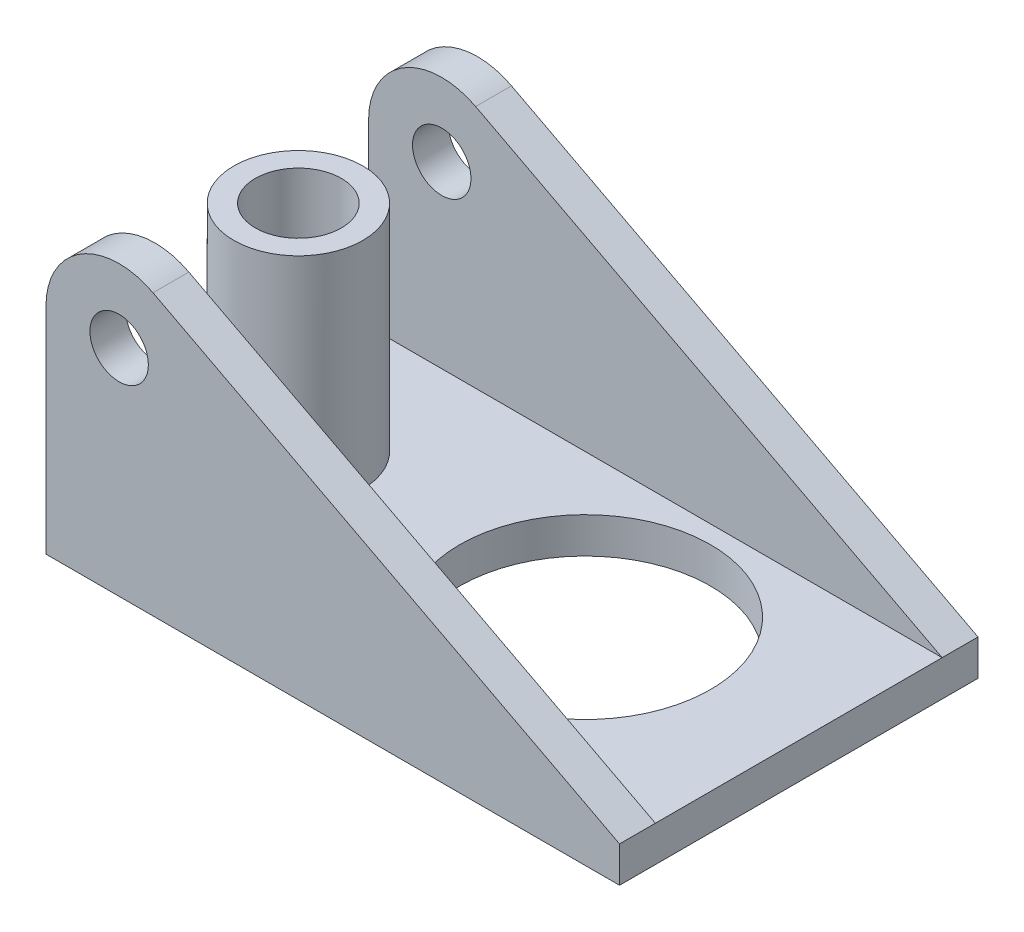
ISO-10303-21;
HEADER;
FILE_DESCRIPTION(('STEP AP214'),'2;1');
FILE_NAME('part.step','',(''),(''),'','','');
FILE_SCHEMA(('AUTOMOTIVE_DESIGN { 1 0 10303 214 1 1 1 1 }'));
ENDSEC;
DATA;
#1=APPLICATION_CONTEXT('core data for automotive mechanical design processes');
#2=APPLICATION_PROTOCOL_DEFINITION('international standard','automotive_design',2000,#1);
#3=PRODUCT_CONTEXT('',#1,'mechanical');
#4=PRODUCT('Part','Part','',(#3));
#5=PRODUCT_RELATED_PRODUCT_CATEGORY('part','',(#4));
#6=PRODUCT_DEFINITION_FORMATION('','',#4);
#7=PRODUCT_DEFINITION_CONTEXT('part definition',#1,'design');
#8=PRODUCT_DEFINITION('design','',#6,#7);
#9=PRODUCT_DEFINITION_SHAPE('','',#8);
#10=(LENGTH_UNIT() NAMED_UNIT(*) SI_UNIT(.MILLI.,.METRE.));
#11=(NAMED_UNIT(*) PLANE_ANGLE_UNIT() SI_UNIT($,.RADIAN.));
#12=(NAMED_UNIT(*) SI_UNIT($,.STERADIAN.) SOLID_ANGLE_UNIT());
#13=UNCERTAINTY_MEASURE_WITH_UNIT(LENGTH_MEASURE(1.E-05),#10,'distance_accuracy_value','');
#14=(GEOMETRIC_REPRESENTATION_CONTEXT(3) GLOBAL_UNCERTAINTY_ASSIGNED_CONTEXT((#13)) GLOBAL_UNIT_ASSIGNED_CONTEXT((#10,
#11,#12)) REPRESENTATION_CONTEXT('',''));
#15=CARTESIAN_POINT('',(0.,0.,0.));
#16=DIRECTION('',(0.,0.,1.));
#17=DIRECTION('',(1.,0.,0.));
#18=AXIS2_PLACEMENT_3D('',#15,#16,#17);
#19=CARTESIAN_POINT('',(0.,0.,-87.401601815985));
#20=DIRECTION('',(0.,-1.,0.));
#21=DIRECTION('',(0.,0.,-1.));
#22=AXIS2_PLACEMENT_3D('',#19,#20,#21);
#23=PLANE('',#22);
#24=DIRECTION('',(0.,0.,1.));
#25=VECTOR('',#24,1.);
#26=CARTESIAN_POINT('',(0.,0.,-87.401601815985));
#27=LINE('',#26,#25);
#28=CARTESIAN_POINT('',(0.,0.,5.));
#29=VERTEX_POINT('',#28);
#30=CARTESIAN_POINT('',(0.,0.,45.));
#31=VERTEX_POINT('',#30);
#32=EDGE_CURVE('E228',#29,#31,#27,.T.);
#33=ORIENTED_EDGE('',*,*,#32,.T.);
#34=DIRECTION('',(1.,0.,0.));
#35=VECTOR('',#34,1.);
#36=CARTESIAN_POINT('',(0.,0.,45.));
#37=LINE('',#36,#35);
#38=CARTESIAN_POINT('',(80.,0.,45.));
#39=VERTEX_POINT('',#38);
#40=EDGE_CURVE('E240',#31,#39,#37,.T.);
#41=ORIENTED_EDGE('',*,*,#40,.T.);
#42=DIRECTION('',(0.,0.,1.));
#43=VECTOR('',#42,1.);
#44=CARTESIAN_POINT('',(80.,0.,-87.401601815985));
#45=LINE('',#44,#43);
#46=CARTESIAN_POINT('',(80.,0.,5.));
#47=VERTEX_POINT('',#46);
#48=EDGE_CURVE('E132',#47,#39,#45,.T.);
#49=ORIENTED_EDGE('',*,*,#48,.F.);
#50=DIRECTION('',(1.,0.,0.));
#51=VECTOR('',#50,1.);
#52=CARTESIAN_POINT('',(0.,0.,5.));
#53=LINE('',#52,#51);
#54=EDGE_CURVE('E236',#29,#47,#53,.T.);
#55=ORIENTED_EDGE('',*,*,#54,.F.);
#56=EDGE_LOOP('',(#33,#41,#49,#55));
#57=FACE_BOUND('',#56,.T.);
#58=CARTESIAN_POINT('',(50.2,0.,25.));
#59=DIRECTION('',(0.,1.,0.));
#60=DIRECTION('',(-1.,0.,0.));
#61=AXIS2_PLACEMENT_3D('',#58,#59,#60);
#62=CIRCLE('',#61,17.5);
#63=CARTESIAN_POINT('',(32.7,0.,25.));
#64=VERTEX_POINT('',#63);
#65=EDGE_CURVE('E259',#64,#64,#62,.T.);
#66=ORIENTED_EDGE('',*,*,#65,.F.);
#67=EDGE_LOOP('',(#66));
#68=FACE_BOUND('',#67,.T.);
#69=CARTESIAN_POINT('',(10.2,0.,25.));
#70=DIRECTION('',(0.,-1.,0.));
#71=DIRECTION('',(0.,0.,-1.));
#72=AXIS2_PLACEMENT_3D('',#69,#70,#71);
#73=CIRCLE('',#72,9.);
#74=CARTESIAN_POINT('',(10.2,0.,16.));
#75=VERTEX_POINT('',#74);
#76=EDGE_CURVE('E12',#75,#75,#73,.F.);
#77=ORIENTED_EDGE('',*,*,#76,.F.);
#78=EDGE_LOOP('',(#77));
#79=FACE_BOUND('',#78,.T.);
#80=ADVANCED_FACE('F49',(#57,#68,#79),#23,.F.);
#81=CARTESIAN_POINT('',(14.9277151352531,34.0381806576268,50.));
#82=DIRECTION('',(-0.463501483848347,-0.886096142904584,0.));
#83=DIRECTION('',(0.886096142904584,-0.463501483848347,0.));
#84=AXIS2_PLACEMENT_3D('',#81,#82,#83);
#85=PLANE('',#84);
#86=DIRECTION('',(0.,0.,-1.));
#87=VECTOR('',#86,1.);
#88=CARTESIAN_POINT('',(14.9277151352531,34.0381806576268,50.));
#89=LINE('',#88,#87);
#90=CARTESIAN_POINT('',(14.9277151352531,34.0381806576268,5.));
#91=VERTEX_POINT('',#90);
#92=CARTESIAN_POINT('',(14.9277151352531,34.0381806576268,0.));
#93=VERTEX_POINT('',#92);
#94=EDGE_CURVE('E170',#91,#93,#89,.T.);
#95=ORIENTED_EDGE('',*,*,#94,.F.);
#96=DIRECTION('',(-0.886096142904584,0.463501483848347,0.));
#97=VECTOR('',#96,1.);
#98=CARTESIAN_POINT('',(80.,0.,5.));
#99=LINE('',#98,#97);
#100=EDGE_CURVE('E214',#47,#91,#99,.T.);
#101=ORIENTED_EDGE('',*,*,#100,.F.);
#102=DIRECTION('',(0.,0.,-1.));
#103=VECTOR('',#102,1.);
#104=CARTESIAN_POINT('',(80.,0.,50.));
#105=LINE('',#104,#103);
#106=CARTESIAN_POINT('',(80.,0.,0.));
#107=VERTEX_POINT('',#106);
#108=EDGE_CURVE('E137',#47,#107,#105,.T.);
#109=ORIENTED_EDGE('',*,*,#108,.T.);
#110=DIRECTION('',(-0.886096142904584,0.463501483848347,0.));
#111=VECTOR('',#110,1.);
#112=CARTESIAN_POINT('',(14.9277151352531,34.0381806576268,0.));
#113=LINE('',#112,#111);
#114=EDGE_CURVE('E157',#107,#93,#113,.T.);
#115=ORIENTED_EDGE('',*,*,#114,.T.);
#116=EDGE_LOOP('',(#95,#101,#109,#115));
#117=FACE_BOUND('',#116,.T.);
#118=ADVANCED_FACE('F210',(#117),#85,.F.);
#119=CARTESIAN_POINT('',(10.2,25.,50.));
#120=DIRECTION('',(0.,0.,-1.));
#121=DIRECTION('',(-1.,0.,0.));
#122=AXIS2_PLACEMENT_3D('',#119,#120,#121);
#123=CYLINDRICAL_SURFACE('',#122,10.2);
#124=DIRECTION('',(0.,0.,-1.));
#125=VECTOR('',#124,1.);
#126=CARTESIAN_POINT('',(0.,25.,50.));
#127=LINE('',#126,#125);
#128=CARTESIAN_POINT('',(0.,25.,5.));
#129=VERTEX_POINT('',#128);
#130=CARTESIAN_POINT('',(0.,25.,0.));
#131=VERTEX_POINT('',#130);
#132=EDGE_CURVE('E97',#129,#131,#127,.T.);
#133=ORIENTED_EDGE('',*,*,#132,.F.);
#134=CARTESIAN_POINT('',(10.2,25.,5.));
#135=DIRECTION('',(0.,0.,-1.));
#136=DIRECTION('',(-1.,0.,0.));
#137=AXIS2_PLACEMENT_3D('',#134,#135,#136);
#138=CIRCLE('',#137,10.2);
#139=EDGE_CURVE('E221',#91,#129,#138,.F.);
#140=ORIENTED_EDGE('',*,*,#139,.F.);
#141=ORIENTED_EDGE('',*,*,#94,.T.);
#142=CARTESIAN_POINT('',(10.2,25.,0.));
#143=DIRECTION('',(0.,0.,1.));
#144=DIRECTION('',(-1.,0.,0.));
#145=AXIS2_PLACEMENT_3D('',#142,#143,#144);
#146=CIRCLE('',#145,10.2);
#147=EDGE_CURVE('E161',#93,#131,#146,.T.);
#148=ORIENTED_EDGE('',*,*,#147,.T.);
#149=EDGE_LOOP('',(#133,#140,#141,#148));
#150=FACE_BOUND('',#149,.T.);
#151=ADVANCED_FACE('F220',(#150),#123,.T.);
#152=CARTESIAN_POINT('',(10.2,25.,50.));
#153=DIRECTION('',(0.,0.,-1.));
#154=DIRECTION('',(-1.,0.,0.));
#155=AXIS2_PLACEMENT_3D('',#152,#153,#154);
#156=CYLINDRICAL_SURFACE('',#155,4.075);
#157=CARTESIAN_POINT('',(10.2,25.,5.));
#158=DIRECTION('',(0.,0.,-1.));
#159=DIRECTION('',(-1.,0.,0.));
#160=AXIS2_PLACEMENT_3D('',#157,#158,#159);
#161=CIRCLE('',#160,4.075);
#162=CARTESIAN_POINT('',(6.125,25.,5.));
#163=VERTEX_POINT('',#162);
#164=EDGE_CURVE('E180',#163,#163,#161,.T.);
#165=ORIENTED_EDGE('',*,*,#164,.F.);
#166=EDGE_LOOP('',(#165));
#167=FACE_BOUND('',#166,.T.);
#168=CARTESIAN_POINT('',(10.2,25.,0.));
#169=DIRECTION('',(0.,0.,1.));
#170=DIRECTION('',(1.,0.,0.));
#171=AXIS2_PLACEMENT_3D('',#168,#169,#170);
#172=CIRCLE('',#171,4.075);
#173=CARTESIAN_POINT('',(14.275,25.,0.));
#174=VERTEX_POINT('',#173);
#175=EDGE_CURVE('E183',#174,#174,#172,.T.);
#176=ORIENTED_EDGE('',*,*,#175,.F.);
#177=EDGE_LOOP('',(#176));
#178=FACE_BOUND('',#177,.T.);
#179=ADVANCED_FACE('F311',(#167,#178),#156,.F.);
#180=CARTESIAN_POINT('',(10.2,25.,50.));
#181=DIRECTION('',(0.,0.,-1.));
#182=DIRECTION('',(-1.,0.,0.));
#183=AXIS2_PLACEMENT_3D('',#180,#181,#182);
#184=PLANE('',#183);
#185=DIRECTION('',(0.,-1.,0.));
#186=VECTOR('',#185,1.);
#187=CARTESIAN_POINT('',(0.,0.,50.));
#188=LINE('',#187,#186);
#189=CARTESIAN_POINT('',(0.,25.,50.));
#190=VERTEX_POINT('',#189);
#191=CARTESIAN_POINT('',(0.,-5.,50.));
#192=VERTEX_POINT('',#191);
#193=EDGE_CURVE('E74',#190,#192,#188,.T.);
#194=ORIENTED_EDGE('',*,*,#193,.T.);
#195=DIRECTION('',(1.,0.,0.));
#196=VECTOR('',#195,1.);
#197=CARTESIAN_POINT('',(0.,-5.,50.));
#198=LINE('',#197,#196);
#199=CARTESIAN_POINT('',(80.,-5.,50.));
#200=VERTEX_POINT('',#199);
#201=EDGE_CURVE('E106',#192,#200,#198,.T.);
#202=ORIENTED_EDGE('',*,*,#201,.T.);
#203=DIRECTION('',(0.,1.,0.));
#204=VECTOR('',#203,1.);
#205=CARTESIAN_POINT('',(80.,-5.,50.));
#206=LINE('',#205,#204);
#207=CARTESIAN_POINT('',(80.,0.,50.));
#208=VERTEX_POINT('',#207);
#209=EDGE_CURVE('E114',#200,#208,#206,.T.);
#210=ORIENTED_EDGE('',*,*,#209,.T.);
#211=DIRECTION('',(-0.886096142904584,0.463501483848347,0.));
#212=VECTOR('',#211,1.);
#213=CARTESIAN_POINT('',(14.9277151352531,34.0381806576268,50.));
#214=LINE('',#213,#212);
#215=CARTESIAN_POINT('',(14.9277151352531,34.0381806576268,50.));
#216=VERTEX_POINT('',#215);
#217=EDGE_CURVE('E119',#208,#216,#214,.T.);
#218=ORIENTED_EDGE('',*,*,#217,.T.);
#219=CARTESIAN_POINT('',(10.2,25.,50.));
#220=DIRECTION('',(0.,0.,1.));
#221=DIRECTION('',(-1.,0.,0.));
#222=AXIS2_PLACEMENT_3D('',#219,#220,#221);
#223=CIRCLE('',#222,10.2);
#224=EDGE_CURVE('E144',#216,#190,#223,.T.);
#225=ORIENTED_EDGE('',*,*,#224,.T.);
#226=EDGE_LOOP('',(#194,#202,#210,#218,#225));
#227=FACE_BOUND('',#226,.T.);
#228=CARTESIAN_POINT('',(10.2,25.,50.));
#229=DIRECTION('',(0.,0.,1.));
#230=DIRECTION('',(1.,0.,0.));
#231=AXIS2_PLACEMENT_3D('',#228,#229,#230);
#232=CIRCLE('',#231,4.075);
#233=CARTESIAN_POINT('',(14.275,25.,50.));
#234=VERTEX_POINT('',#233);
#235=EDGE_CURVE('E154',#234,#234,#232,.T.);
#236=ORIENTED_EDGE('',*,*,#235,.F.);
#237=EDGE_LOOP('',(#236));
#238=FACE_BOUND('',#237,.T.);
#239=ADVANCED_FACE('F116',(#227,#238),#184,.F.);
#240=CARTESIAN_POINT('',(10.2,25.,0.));
#241=DIRECTION('',(0.,0.,-1.));
#242=DIRECTION('',(-1.,0.,0.));
#243=AXIS2_PLACEMENT_3D('',#240,#241,#242);
#244=PLANE('',#243);
#245=DIRECTION('',(1.,0.,0.));
#246=VECTOR('',#245,1.);
#247=CARTESIAN_POINT('',(0.,-5.,0.));
#248=LINE('',#247,#246);
#249=CARTESIAN_POINT('',(0.,-5.,0.));
#250=VERTEX_POINT('',#249);
#251=CARTESIAN_POINT('',(80.,-5.,0.));
#252=VERTEX_POINT('',#251);
#253=EDGE_CURVE('E150',#250,#252,#248,.T.);
#254=ORIENTED_EDGE('',*,*,#253,.F.);
#255=DIRECTION('',(0.,-1.,0.));
#256=VECTOR('',#255,1.);
#257=CARTESIAN_POINT('',(0.,0.,0.));
#258=LINE('',#257,#256);
#259=EDGE_CURVE('E164',#131,#250,#258,.T.);
#260=ORIENTED_EDGE('',*,*,#259,.F.);
#261=ORIENTED_EDGE('',*,*,#147,.F.);
#262=ORIENTED_EDGE('',*,*,#114,.F.);
#263=DIRECTION('',(0.,1.,0.));
#264=VECTOR('',#263,1.);
#265=CARTESIAN_POINT('',(80.,-5.,0.));
#266=LINE('',#265,#264);
#267=EDGE_CURVE('E153',#252,#107,#266,.T.);
#268=ORIENTED_EDGE('',*,*,#267,.F.);
#269=EDGE_LOOP('',(#254,#260,#261,#262,#268));
#270=FACE_BOUND('',#269,.T.);
#271=ORIENTED_EDGE('',*,*,#175,.T.);
#272=EDGE_LOOP('',(#271));
#273=FACE_BOUND('',#272,.T.);
#274=ADVANCED_FACE('F206',(#270,#273),#244,.T.);
#275=CARTESIAN_POINT('',(0.,-5.,50.));
#276=DIRECTION('',(0.,1.,0.));
#277=DIRECTION('',(-1.,0.,0.));
#278=AXIS2_PLACEMENT_3D('',#275,#276,#277);
#279=PLANE('',#278);
#280=CARTESIAN_POINT('',(10.2,-5.,25.));
#281=DIRECTION('',(0.,1.,0.));
#282=DIRECTION('',(-1.,0.,0.));
#283=AXIS2_PLACEMENT_3D('',#280,#281,#282);
#284=CIRCLE('',#283,6.);
#285=CARTESIAN_POINT('',(4.2,-5.,25.));
#286=VERTEX_POINT('',#285);
#287=EDGE_CURVE('E245',#286,#286,#284,.T.);
#288=ORIENTED_EDGE('',*,*,#287,.T.);
#289=EDGE_LOOP('',(#288));
#290=FACE_BOUND('',#289,.T.);
#291=CARTESIAN_POINT('',(50.2,-5.,25.));
#292=DIRECTION('',(0.,1.,0.));
#293=DIRECTION('',(-1.,0.,0.));
#294=AXIS2_PLACEMENT_3D('',#291,#292,#293);
#295=CIRCLE('',#294,17.5);
#296=CARTESIAN_POINT('',(32.7,-5.,25.));
#297=VERTEX_POINT('',#296);
#298=EDGE_CURVE('E255',#297,#297,#295,.T.);
#299=ORIENTED_EDGE('',*,*,#298,.T.);
#300=EDGE_LOOP('',(#299));
#301=FACE_BOUND('',#300,.T.);
#302=ORIENTED_EDGE('',*,*,#253,.T.);
#303=DIRECTION('',(0.,0.,-1.));
#304=VECTOR('',#303,1.);
#305=CARTESIAN_POINT('',(80.,-5.,50.));
#306=LINE('',#305,#304);
#307=EDGE_CURVE('E136',#200,#252,#306,.T.);
#308=ORIENTED_EDGE('',*,*,#307,.F.);
#309=ORIENTED_EDGE('',*,*,#201,.F.);
#310=DIRECTION('',(0.,0.,-1.));
#311=VECTOR('',#310,1.);
#312=CARTESIAN_POINT('',(0.,-5.,50.));
#313=LINE('',#312,#311);
#314=EDGE_CURVE('E58',#192,#250,#313,.T.);
#315=ORIENTED_EDGE('',*,*,#314,.T.);
#316=EDGE_LOOP('',(#302,#308,#309,#315));
#317=FACE_BOUND('',#316,.T.);
#318=ADVANCED_FACE('F51',(#290,#301,#317),#279,.F.);
#319=CARTESIAN_POINT('',(80.,-5.,50.));
#320=DIRECTION('',(-1.,0.,0.));
#321=DIRECTION('',(0.,0.,1.));
#322=AXIS2_PLACEMENT_3D('',#319,#320,#321);
#323=PLANE('',#322);
#324=ORIENTED_EDGE('',*,*,#267,.T.);
#325=ORIENTED_EDGE('',*,*,#108,.F.);
#326=ORIENTED_EDGE('',*,*,#48,.T.);
#327=EDGE_CURVE('E127',#208,#39,#105,.T.);
#328=ORIENTED_EDGE('',*,*,#327,.F.);
#329=ORIENTED_EDGE('',*,*,#209,.F.);
#330=ORIENTED_EDGE('',*,*,#307,.T.);
#331=EDGE_LOOP('',(#324,#325,#326,#328,#329,#330));
#332=FACE_BOUND('',#331,.T.);
#333=ADVANCED_FACE('F129',(#332),#323,.F.);
#334=ORIENTED_EDGE('',*,*,#327,.T.);
#335=DIRECTION('',(-0.886096142904584,0.463501483848347,0.));
#336=VECTOR('',#335,1.);
#337=CARTESIAN_POINT('',(80.,0.,45.));
#338=LINE('',#337,#336);
#339=CARTESIAN_POINT('',(14.9277151352531,34.0381806576268,45.));
#340=VERTEX_POINT('',#339);
#341=EDGE_CURVE('E244',#39,#340,#338,.T.);
#342=ORIENTED_EDGE('',*,*,#341,.T.);
#343=EDGE_CURVE('E141',#216,#340,#89,.T.);
#344=ORIENTED_EDGE('',*,*,#343,.F.);
#345=ORIENTED_EDGE('',*,*,#217,.F.);
#346=EDGE_LOOP('',(#334,#342,#344,#345));
#347=FACE_BOUND('',#346,.T.);
#348=ADVANCED_FACE('F139',(#347),#85,.F.);
#349=ORIENTED_EDGE('',*,*,#343,.T.);
#350=CARTESIAN_POINT('',(10.2,25.,45.));
#351=DIRECTION('',(0.,0.,1.));
#352=DIRECTION('',(1.,0.,0.));
#353=AXIS2_PLACEMENT_3D('',#350,#351,#352);
#354=CIRCLE('',#353,10.2);
#355=CARTESIAN_POINT('',(0.,25.,45.));
#356=VERTEX_POINT('',#355);
#357=EDGE_CURVE('E248',#340,#356,#354,.T.);
#358=ORIENTED_EDGE('',*,*,#357,.T.);
#359=EDGE_CURVE('E167',#190,#356,#127,.T.);
#360=ORIENTED_EDGE('',*,*,#359,.F.);
#361=ORIENTED_EDGE('',*,*,#224,.F.);
#362=EDGE_LOOP('',(#349,#358,#360,#361));
#363=FACE_BOUND('',#362,.T.);
#364=ADVANCED_FACE('F318',(#363),#123,.T.);
#365=CARTESIAN_POINT('',(0.,0.,50.));
#366=DIRECTION('',(1.,0.,0.));
#367=DIRECTION('',(0.,0.,-1.));
#368=AXIS2_PLACEMENT_3D('',#365,#366,#367);
#369=PLANE('',#368);
#370=ORIENTED_EDGE('',*,*,#32,.F.);
#371=DIRECTION('',(0.,-1.,0.));
#372=VECTOR('',#371,1.);
#373=CARTESIAN_POINT('',(0.,25.,5.));
#374=LINE('',#373,#372);
#375=EDGE_CURVE('E65',#129,#29,#374,.T.);
#376=ORIENTED_EDGE('',*,*,#375,.F.);
#377=ORIENTED_EDGE('',*,*,#132,.T.);
#378=ORIENTED_EDGE('',*,*,#259,.T.);
#379=ORIENTED_EDGE('',*,*,#314,.F.);
#380=ORIENTED_EDGE('',*,*,#193,.F.);
#381=ORIENTED_EDGE('',*,*,#359,.T.);
#382=DIRECTION('',(0.,-1.,0.));
#383=VECTOR('',#382,1.);
#384=CARTESIAN_POINT('',(0.,25.,45.));
#385=LINE('',#384,#383);
#386=EDGE_CURVE('E230',#356,#31,#385,.T.);
#387=ORIENTED_EDGE('',*,*,#386,.T.);
#388=EDGE_LOOP('',(#370,#376,#377,#378,#379,#380,#381,#387));
#389=FACE_BOUND('',#388,.T.);
#390=ADVANCED_FACE('F200',(#389),#369,.F.);
#391=CARTESIAN_POINT('',(10.2,25.,45.));
#392=DIRECTION('',(0.,0.,1.));
#393=DIRECTION('',(1.,0.,0.));
#394=AXIS2_PLACEMENT_3D('',#391,#392,#393);
#395=CIRCLE('',#394,4.075);
#396=CARTESIAN_POINT('',(14.275,25.,45.));
#397=VERTEX_POINT('',#396);
#398=EDGE_CURVE('E177',#397,#397,#395,.T.);
#399=ORIENTED_EDGE('',*,*,#398,.F.);
#400=EDGE_LOOP('',(#399));
#401=FACE_BOUND('',#400,.T.);
#402=ORIENTED_EDGE('',*,*,#235,.T.);
#403=EDGE_LOOP('',(#402));
#404=FACE_BOUND('',#403,.T.);
#405=ADVANCED_FACE('F307',(#401,#404),#156,.F.);
#406=CARTESIAN_POINT('',(10.2,25.,5.));
#407=DIRECTION('',(0.,0.,-1.));
#408=DIRECTION('',(-1.,0.,0.));
#409=AXIS2_PLACEMENT_3D('',#406,#407,#408);
#410=PLANE('',#409);
#411=ORIENTED_EDGE('',*,*,#164,.T.);
#412=EDGE_LOOP('',(#411));
#413=FACE_BOUND('',#412,.T.);
#414=ORIENTED_EDGE('',*,*,#54,.T.);
#415=ORIENTED_EDGE('',*,*,#100,.T.);
#416=ORIENTED_EDGE('',*,*,#139,.T.);
#417=ORIENTED_EDGE('',*,*,#375,.T.);
#418=EDGE_LOOP('',(#414,#415,#416,#417));
#419=FACE_BOUND('',#418,.T.);
#420=ADVANCED_FACE('F304',(#413,#419),#410,.F.);
#421=CARTESIAN_POINT('',(10.2,25.,45.));
#422=DIRECTION('',(0.,0.,1.));
#423=DIRECTION('',(1.,0.,0.));
#424=AXIS2_PLACEMENT_3D('',#421,#422,#423);
#425=PLANE('',#424);
#426=ORIENTED_EDGE('',*,*,#398,.T.);
#427=EDGE_LOOP('',(#426));
#428=FACE_BOUND('',#427,.T.);
#429=ORIENTED_EDGE('',*,*,#40,.F.);
#430=ORIENTED_EDGE('',*,*,#386,.F.);
#431=ORIENTED_EDGE('',*,*,#357,.F.);
#432=ORIENTED_EDGE('',*,*,#341,.F.);
#433=EDGE_LOOP('',(#429,#430,#431,#432));
#434=FACE_BOUND('',#433,.T.);
#435=ADVANCED_FACE('F302',(#428,#434),#425,.F.);
#436=CARTESIAN_POINT('',(50.2,-5.,25.));
#437=DIRECTION('',(0.,1.,0.));
#438=DIRECTION('',(-1.,0.,0.));
#439=AXIS2_PLACEMENT_3D('',#436,#437,#438);
#440=CYLINDRICAL_SURFACE('',#439,17.5);
#441=ORIENTED_EDGE('',*,*,#298,.F.);
#442=EDGE_LOOP('',(#441));
#443=FACE_BOUND('',#442,.T.);
#444=ORIENTED_EDGE('',*,*,#65,.T.);
#445=EDGE_LOOP('',(#444));
#446=FACE_BOUND('',#445,.T.);
#447=ADVANCED_FACE('F288',(#443,#446),#440,.F.);
#448=CARTESIAN_POINT('',(10.2,-5.,25.));
#449=DIRECTION('',(0.,1.,0.));
#450=DIRECTION('',(-1.,0.,0.));
#451=AXIS2_PLACEMENT_3D('',#448,#449,#450);
#452=CYLINDRICAL_SURFACE('',#451,6.);
#453=ORIENTED_EDGE('',*,*,#287,.F.);
#454=EDGE_LOOP('',(#453));
#455=FACE_BOUND('',#454,.T.);
#456=CARTESIAN_POINT('',(10.2,30.,25.));
#457=DIRECTION('',(0.,1.,0.));
#458=DIRECTION('',(0.,0.,1.));
#459=AXIS2_PLACEMENT_3D('',#456,#457,#458);
#460=CIRCLE('',#459,6.);
#461=CARTESIAN_POINT('',(10.2,30.,31.));
#462=VERTEX_POINT('',#461);
#463=EDGE_CURVE('E270',#462,#462,#460,.T.);
#464=ORIENTED_EDGE('',*,*,#463,.T.);
#465=EDGE_LOOP('',(#464));
#466=FACE_BOUND('',#465,.T.);
#467=ADVANCED_FACE('F275',(#455,#466),#452,.F.);
#468=CARTESIAN_POINT('',(10.2,30.,25.));
#469=DIRECTION('',(0.,1.,0.));
#470=DIRECTION('',(0.,0.,1.));
#471=AXIS2_PLACEMENT_3D('',#468,#469,#470);
#472=PLANE('',#471);
#473=CARTESIAN_POINT('',(10.2,30.,25.));
#474=DIRECTION('',(0.,1.,0.));
#475=DIRECTION('',(0.,0.,1.));
#476=AXIS2_PLACEMENT_3D('',#473,#474,#475);
#477=CIRCLE('',#476,9.);
#478=CARTESIAN_POINT('',(10.2,30.,34.));
#479=VERTEX_POINT('',#478);
#480=EDGE_CURVE('E260',#479,#479,#477,.T.);
#481=ORIENTED_EDGE('',*,*,#480,.T.);
#482=EDGE_LOOP('',(#481));
#483=FACE_BOUND('',#482,.T.);
#484=ORIENTED_EDGE('',*,*,#463,.F.);
#485=EDGE_LOOP('',(#484));
#486=FACE_BOUND('',#485,.T.);
#487=ADVANCED_FACE('F277',(#483,#486),#472,.T.);
#488=CARTESIAN_POINT('',(10.2,30.,25.));
#489=DIRECTION('',(0.,-1.,0.));
#490=DIRECTION('',(0.,0.,-1.));
#491=AXIS2_PLACEMENT_3D('',#488,#489,#490);
#492=CYLINDRICAL_SURFACE('',#491,9.);
#493=ORIENTED_EDGE('',*,*,#480,.F.);
#494=EDGE_LOOP('',(#493));
#495=FACE_BOUND('',#494,.T.);
#496=ORIENTED_EDGE('',*,*,#76,.T.);
#497=EDGE_LOOP('',(#496));
#498=FACE_BOUND('',#497,.T.);
#499=ADVANCED_FACE('F279',(#495,#498),#492,.T.);
#500=CLOSED_SHELL('',(#80,#118,#151,#179,#239,#274,#318,#333,#348,#364,#390,#405,#420,#435,#447,
#467,#487,#499));
#501=MANIFOLD_SOLID_BREP('B2',#500);
#502=ADVANCED_BREP_SHAPE_REPRESENTATION('',(#18,#501),#14);
#503=SHAPE_DEFINITION_REPRESENTATION(#9,#502);
ENDSEC;
END-ISO-10303-21;
